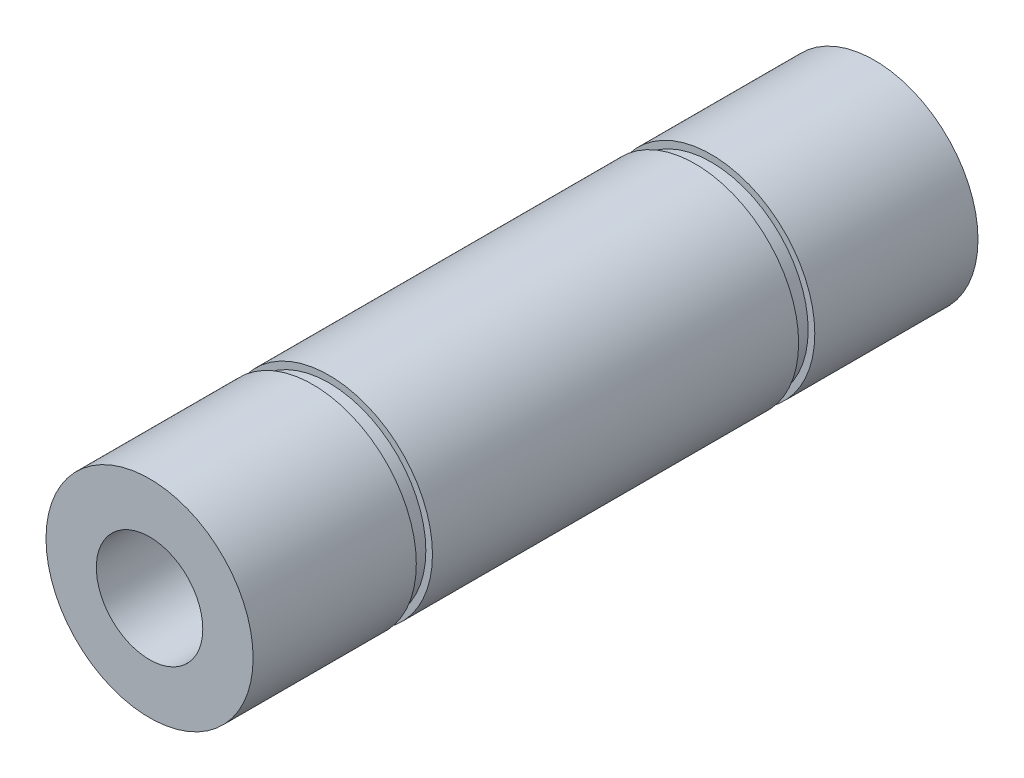
ISO-10303-21;
HEADER;
FILE_DESCRIPTION(('STEP AP214'),'2;1');
FILE_NAME('part.step','',(''),(''),'','','');
FILE_SCHEMA(('AUTOMOTIVE_DESIGN { 1 0 10303 214 1 1 1 1 }'));
ENDSEC;
DATA;
#1=APPLICATION_CONTEXT('core data for automotive mechanical design processes');
#2=APPLICATION_PROTOCOL_DEFINITION('international standard','automotive_design',2000,#1);
#3=PRODUCT_CONTEXT('',#1,'mechanical');
#4=PRODUCT('Part','Part','',(#3));
#5=PRODUCT_RELATED_PRODUCT_CATEGORY('part','',(#4));
#6=PRODUCT_DEFINITION_FORMATION('','',#4);
#7=PRODUCT_DEFINITION_CONTEXT('part definition',#1,'design');
#8=PRODUCT_DEFINITION('design','',#6,#7);
#9=PRODUCT_DEFINITION_SHAPE('','',#8);
#10=(LENGTH_UNIT() NAMED_UNIT(*) SI_UNIT(.MILLI.,.METRE.));
#11=(NAMED_UNIT(*) PLANE_ANGLE_UNIT() SI_UNIT($,.RADIAN.));
#12=(NAMED_UNIT(*) SI_UNIT($,.STERADIAN.) SOLID_ANGLE_UNIT());
#13=UNCERTAINTY_MEASURE_WITH_UNIT(LENGTH_MEASURE(1.E-05),#10,'distance_accuracy_value','');
#14=(GEOMETRIC_REPRESENTATION_CONTEXT(3) GLOBAL_UNCERTAINTY_ASSIGNED_CONTEXT((#13)) GLOBAL_UNIT_ASSIGNED_CONTEXT((#10,
#11,#12)) REPRESENTATION_CONTEXT('',''));
#15=CARTESIAN_POINT('',(0.,0.,0.));
#16=DIRECTION('',(0.,0.,1.));
#17=DIRECTION('',(1.,0.,0.));
#18=AXIS2_PLACEMENT_3D('',#15,#16,#17);
#19=CARTESIAN_POINT('',(0.,0.,22.225));
#20=DIRECTION('',(0.,0.,-1.));
#21=DIRECTION('',(-1.,0.,0.));
#22=AXIS2_PLACEMENT_3D('',#19,#20,#21);
#23=CYLINDRICAL_SURFACE('',#22,6.35);
#24=CARTESIAN_POINT('',(0.,0.,-11.2268));
#25=DIRECTION('',(0.,0.,1.));
#26=DIRECTION('',(1.,0.,0.));
#27=AXIS2_PLACEMENT_3D('',#24,#25,#26);
#28=CIRCLE('',#27,6.35);
#29=CARTESIAN_POINT('',(6.35,0.,-11.2268));
#30=VERTEX_POINT('',#29);
#31=EDGE_CURVE('E70',#30,#30,#28,.T.);
#32=ORIENTED_EDGE('',*,*,#31,.T.);
#33=EDGE_LOOP('',(#32));
#34=FACE_BOUND('',#33,.T.);
#35=CARTESIAN_POINT('',(0.,0.,11.2268));
#36=DIRECTION('',(0.,0.,1.));
#37=DIRECTION('',(1.,0.,0.));
#38=AXIS2_PLACEMENT_3D('',#35,#36,#37);
#39=CIRCLE('',#38,6.35);
#40=CARTESIAN_POINT('',(6.35,0.,11.2268));
#41=VERTEX_POINT('',#40);
#42=EDGE_CURVE('E82',#41,#41,#39,.T.);
#43=ORIENTED_EDGE('',*,*,#42,.F.);
#44=EDGE_LOOP('',(#43));
#45=FACE_BOUND('',#44,.T.);
#46=ADVANCED_FACE('F36',(#34,#45),#23,.T.);
#47=CARTESIAN_POINT('',(0.,0.,22.225));
#48=DIRECTION('',(0.,0.,1.));
#49=DIRECTION('',(1.,0.,0.));
#50=AXIS2_PLACEMENT_3D('',#47,#48,#49);
#51=CIRCLE('',#50,6.35);
#52=CARTESIAN_POINT('',(6.35,0.,22.225));
#53=VERTEX_POINT('',#52);
#54=EDGE_CURVE('E10',#53,#53,#51,.T.);
#55=ORIENTED_EDGE('',*,*,#54,.F.);
#56=EDGE_LOOP('',(#55));
#57=FACE_BOUND('',#56,.T.);
#58=CARTESIAN_POINT('',(0.,0.,12.2174));
#59=DIRECTION('',(0.,0.,1.));
#60=DIRECTION('',(1.,0.,0.));
#61=AXIS2_PLACEMENT_3D('',#58,#59,#60);
#62=CIRCLE('',#61,6.35);
#63=CARTESIAN_POINT('',(6.35,0.,12.2174));
#64=VERTEX_POINT('',#63);
#65=EDGE_CURVE('E79',#64,#64,#62,.T.);
#66=ORIENTED_EDGE('',*,*,#65,.T.);
#67=EDGE_LOOP('',(#66));
#68=FACE_BOUND('',#67,.T.);
#69=ADVANCED_FACE('F89',(#57,#68),#23,.T.);
#70=CARTESIAN_POINT('',(0.,0.,-22.225));
#71=DIRECTION('',(0.,0.,1.));
#72=DIRECTION('',(1.,0.,0.));
#73=AXIS2_PLACEMENT_3D('',#70,#71,#72);
#74=CIRCLE('',#73,6.35);
#75=CARTESIAN_POINT('',(6.35,0.,-22.225));
#76=VERTEX_POINT('',#75);
#77=EDGE_CURVE('E43',#76,#76,#74,.T.);
#78=ORIENTED_EDGE('',*,*,#77,.T.);
#79=EDGE_LOOP('',(#78));
#80=FACE_BOUND('',#79,.T.);
#81=CARTESIAN_POINT('',(0.,0.,-12.2174));
#82=DIRECTION('',(0.,0.,1.));
#83=DIRECTION('',(1.,0.,0.));
#84=AXIS2_PLACEMENT_3D('',#81,#82,#83);
#85=CIRCLE('',#84,6.35);
#86=CARTESIAN_POINT('',(6.35,0.,-12.2174));
#87=VERTEX_POINT('',#86);
#88=EDGE_CURVE('E67',#87,#87,#85,.T.);
#89=ORIENTED_EDGE('',*,*,#88,.F.);
#90=EDGE_LOOP('',(#89));
#91=FACE_BOUND('',#90,.T.);
#92=ADVANCED_FACE('F91',(#80,#91),#23,.T.);
#93=CARTESIAN_POINT('',(0.,0.,22.225));
#94=DIRECTION('',(0.,0.,1.));
#95=DIRECTION('',(1.,0.,0.));
#96=AXIS2_PLACEMENT_3D('',#93,#94,#95);
#97=PLANE('',#96);
#98=CARTESIAN_POINT('',(0.,0.,22.225));
#99=DIRECTION('',(0.,0.,1.));
#100=DIRECTION('',(1.,0.,0.));
#101=AXIS2_PLACEMENT_3D('',#98,#99,#100);
#102=CIRCLE('',#101,3.26389999999999);
#103=CARTESIAN_POINT('',(3.26389999999999,0.,22.225));
#104=VERTEX_POINT('',#103);
#105=EDGE_CURVE('E52',#104,#104,#102,.T.);
#106=ORIENTED_EDGE('',*,*,#105,.F.);
#107=EDGE_LOOP('',(#106));
#108=FACE_BOUND('',#107,.T.);
#109=ORIENTED_EDGE('',*,*,#54,.T.);
#110=EDGE_LOOP('',(#109));
#111=FACE_BOUND('',#110,.T.);
#112=ADVANCED_FACE('F97',(#108,#111),#97,.T.);
#113=CARTESIAN_POINT('',(0.,0.,-22.225));
#114=DIRECTION('',(0.,0.,1.));
#115=DIRECTION('',(1.,0.,0.));
#116=AXIS2_PLACEMENT_3D('',#113,#114,#115);
#117=PLANE('',#116);
#118=CARTESIAN_POINT('',(0.,0.,-22.225));
#119=DIRECTION('',(0.,0.,-1.));
#120=DIRECTION('',(-1.,0.,0.));
#121=AXIS2_PLACEMENT_3D('',#118,#119,#120);
#122=CIRCLE('',#121,3.26389999999999);
#123=CARTESIAN_POINT('',(-3.26389999999999,0.,-22.225));
#124=VERTEX_POINT('',#123);
#125=EDGE_CURVE('E58',#124,#124,#122,.T.);
#126=ORIENTED_EDGE('',*,*,#125,.F.);
#127=EDGE_LOOP('',(#126));
#128=FACE_BOUND('',#127,.T.);
#129=ORIENTED_EDGE('',*,*,#77,.F.);
#130=EDGE_LOOP('',(#129));
#131=FACE_BOUND('',#130,.T.);
#132=ADVANCED_FACE('F102',(#128,#131),#117,.F.);
#133=CARTESIAN_POINT('',(0.,0.,1.905));
#134=DIRECTION('',(0.,0.,1.));
#135=DIRECTION('',(1.,0.,0.));
#136=AXIS2_PLACEMENT_3D('',#133,#134,#135);
#137=CONICAL_SURFACE('',#136,3.2639,1.02974425867665);
#138=CARTESIAN_POINT('',(0.,0.,0.));
#139=DIRECTION('',(0.,0.,-1.));
#140=DIRECTION('',(-1.,0.,0.));
#141=AXIS2_PLACEMENT_3D('',#138,#139,#140);
#142=CIRCLE('',#141,0.0934475861222737);
#143=CARTESIAN_POINT('',(-0.0934475861222737,0.,0.));
#144=VERTEX_POINT('',#143);
#145=EDGE_CURVE('E39',#144,#144,#142,.T.);
#146=ORIENTED_EDGE('',*,*,#145,.T.);
#147=EDGE_LOOP('',(#146));
#148=FACE_BOUND('',#147,.T.);
#149=CARTESIAN_POINT('',(0.,0.,1.905));
#150=DIRECTION('',(0.,0.,1.));
#151=DIRECTION('',(1.,0.,0.));
#152=AXIS2_PLACEMENT_3D('',#149,#150,#151);
#153=CIRCLE('',#152,3.2639);
#154=CARTESIAN_POINT('',(3.2639,0.,1.905));
#155=VERTEX_POINT('',#154);
#156=EDGE_CURVE('E48',#155,#155,#153,.T.);
#157=ORIENTED_EDGE('',*,*,#156,.T.);
#158=EDGE_LOOP('',(#157));
#159=FACE_BOUND('',#158,.T.);
#160=ADVANCED_FACE('F140',(#148,#159),#137,.F.);
#161=CARTESIAN_POINT('',(0.,0.,22.225));
#162=DIRECTION('',(0.,0.,1.));
#163=DIRECTION('',(1.,0.,0.));
#164=AXIS2_PLACEMENT_3D('',#161,#162,#163);
#165=CYLINDRICAL_SURFACE('',#164,3.26389999999999);
#166=ORIENTED_EDGE('',*,*,#156,.F.);
#167=EDGE_LOOP('',(#166));
#168=FACE_BOUND('',#167,.T.);
#169=ORIENTED_EDGE('',*,*,#105,.T.);
#170=EDGE_LOOP('',(#169));
#171=FACE_BOUND('',#170,.T.);
#172=ADVANCED_FACE('F136',(#168,#171),#165,.F.);
#173=CARTESIAN_POINT('',(0.,0.,-1.90499999999999));
#174=DIRECTION('',(0.,0.,-1.));
#175=DIRECTION('',(-1.,0.,0.));
#176=AXIS2_PLACEMENT_3D('',#173,#174,#175);
#177=CONICAL_SURFACE('',#176,3.26389999999999,1.02974425867665);
#178=CARTESIAN_POINT('',(0.,0.,-1.90499999999999));
#179=DIRECTION('',(0.,0.,-1.));
#180=DIRECTION('',(-1.,0.,0.));
#181=AXIS2_PLACEMENT_3D('',#178,#179,#180);
#182=CIRCLE('',#181,3.26389999999999);
#183=CARTESIAN_POINT('',(-3.26389999999999,0.,-1.90499999999999));
#184=VERTEX_POINT('',#183);
#185=EDGE_CURVE('E55',#184,#184,#182,.T.);
#186=ORIENTED_EDGE('',*,*,#185,.T.);
#187=EDGE_LOOP('',(#186));
#188=FACE_BOUND('',#187,.T.);
#189=ORIENTED_EDGE('',*,*,#145,.F.);
#190=EDGE_LOOP('',(#189));
#191=FACE_BOUND('',#190,.T.);
#192=ADVANCED_FACE('F130',(#188,#191),#177,.F.);
#193=CARTESIAN_POINT('',(0.,0.,-22.225));
#194=DIRECTION('',(0.,0.,-1.));
#195=DIRECTION('',(-1.,0.,0.));
#196=AXIS2_PLACEMENT_3D('',#193,#194,#195);
#197=CYLINDRICAL_SURFACE('',#196,3.26389999999999);
#198=ORIENTED_EDGE('',*,*,#185,.F.);
#199=EDGE_LOOP('',(#198));
#200=FACE_BOUND('',#199,.T.);
#201=ORIENTED_EDGE('',*,*,#125,.T.);
#202=EDGE_LOOP('',(#201));
#203=FACE_BOUND('',#202,.T.);
#204=ADVANCED_FACE('F124',(#200,#203),#197,.F.);
#205=CARTESIAN_POINT('',(0.,6.35,-11.2268));
#206=DIRECTION('',(0.,0.,-1.));
#207=DIRECTION('',(-1.,0.,0.));
#208=AXIS2_PLACEMENT_3D('',#205,#206,#207);
#209=PLANE('',#208);
#210=CARTESIAN_POINT('',(0.,0.,-11.2268));
#211=DIRECTION('',(0.,0.,1.));
#212=DIRECTION('',(1.,0.,0.));
#213=AXIS2_PLACEMENT_3D('',#210,#211,#212);
#214=CIRCLE('',#213,5.9436);
#215=CARTESIAN_POINT('',(5.9436,0.,-11.2268));
#216=VERTEX_POINT('',#215);
#217=EDGE_CURVE('E61',#216,#216,#214,.T.);
#218=ORIENTED_EDGE('',*,*,#217,.T.);
#219=EDGE_LOOP('',(#218));
#220=FACE_BOUND('',#219,.T.);
#221=ORIENTED_EDGE('',*,*,#31,.F.);
#222=EDGE_LOOP('',(#221));
#223=FACE_BOUND('',#222,.T.);
#224=ADVANCED_FACE('F118',(#220,#223),#209,.T.);
#225=CARTESIAN_POINT('',(0.,0.,22.225));
#226=DIRECTION('',(0.,0.,1.));
#227=DIRECTION('',(1.,0.,0.));
#228=AXIS2_PLACEMENT_3D('',#225,#226,#227);
#229=CYLINDRICAL_SURFACE('',#228,5.9436);
#230=CARTESIAN_POINT('',(0.,0.,-12.2174));
#231=DIRECTION('',(0.,0.,1.));
#232=DIRECTION('',(1.,0.,0.));
#233=AXIS2_PLACEMENT_3D('',#230,#231,#232);
#234=CIRCLE('',#233,5.9436);
#235=CARTESIAN_POINT('',(5.9436,0.,-12.2174));
#236=VERTEX_POINT('',#235);
#237=EDGE_CURVE('E64',#236,#236,#234,.T.);
#238=ORIENTED_EDGE('',*,*,#237,.T.);
#239=EDGE_LOOP('',(#238));
#240=FACE_BOUND('',#239,.T.);
#241=ORIENTED_EDGE('',*,*,#217,.F.);
#242=EDGE_LOOP('',(#241));
#243=FACE_BOUND('',#242,.T.);
#244=ADVANCED_FACE('F112',(#240,#243),#229,.T.);
#245=CARTESIAN_POINT('',(0.,6.35,-12.2174));
#246=DIRECTION('',(0.,0.,1.));
#247=DIRECTION('',(1.,0.,0.));
#248=AXIS2_PLACEMENT_3D('',#245,#246,#247);
#249=PLANE('',#248);
#250=ORIENTED_EDGE('',*,*,#88,.T.);
#251=EDGE_LOOP('',(#250));
#252=FACE_BOUND('',#251,.T.);
#253=ORIENTED_EDGE('',*,*,#237,.F.);
#254=EDGE_LOOP('',(#253));
#255=FACE_BOUND('',#254,.T.);
#256=ADVANCED_FACE('F109',(#252,#255),#249,.T.);
#257=CARTESIAN_POINT('',(0.,6.35,11.2268));
#258=DIRECTION('',(0.,0.,1.));
#259=DIRECTION('',(-1.,0.,0.));
#260=AXIS2_PLACEMENT_3D('',#257,#258,#259);
#261=PLANE('',#260);
#262=CARTESIAN_POINT('',(0.,0.,11.2268));
#263=DIRECTION('',(0.,0.,1.));
#264=DIRECTION('',(1.,0.,0.));
#265=AXIS2_PLACEMENT_3D('',#262,#263,#264);
#266=CIRCLE('',#265,5.9436);
#267=CARTESIAN_POINT('',(5.9436,0.,11.2268));
#268=VERTEX_POINT('',#267);
#269=EDGE_CURVE('E73',#268,#268,#266,.T.);
#270=ORIENTED_EDGE('',*,*,#269,.F.);
#271=EDGE_LOOP('',(#270));
#272=FACE_BOUND('',#271,.T.);
#273=ORIENTED_EDGE('',*,*,#42,.T.);
#274=EDGE_LOOP('',(#273));
#275=FACE_BOUND('',#274,.T.);
#276=ADVANCED_FACE('F86',(#272,#275),#261,.T.);
#277=CARTESIAN_POINT('',(0.,0.,-22.225));
#278=DIRECTION('',(0.,0.,-1.));
#279=DIRECTION('',(1.,0.,0.));
#280=AXIS2_PLACEMENT_3D('',#277,#278,#279);
#281=CYLINDRICAL_SURFACE('',#280,5.9436);
#282=CARTESIAN_POINT('',(0.,0.,12.2174));
#283=DIRECTION('',(0.,0.,1.));
#284=DIRECTION('',(1.,0.,0.));
#285=AXIS2_PLACEMENT_3D('',#282,#283,#284);
#286=CIRCLE('',#285,5.9436);
#287=CARTESIAN_POINT('',(5.9436,0.,12.2174));
#288=VERTEX_POINT('',#287);
#289=EDGE_CURVE('E76',#288,#288,#286,.T.);
#290=ORIENTED_EDGE('',*,*,#289,.F.);
#291=EDGE_LOOP('',(#290));
#292=FACE_BOUND('',#291,.T.);
#293=ORIENTED_EDGE('',*,*,#269,.T.);
#294=EDGE_LOOP('',(#293));
#295=FACE_BOUND('',#294,.T.);
#296=ADVANCED_FACE('F210',(#292,#295),#281,.T.);
#297=CARTESIAN_POINT('',(0.,6.35,12.2174));
#298=DIRECTION('',(0.,0.,-1.));
#299=DIRECTION('',(1.,0.,0.));
#300=AXIS2_PLACEMENT_3D('',#297,#298,#299);
#301=PLANE('',#300);
#302=ORIENTED_EDGE('',*,*,#65,.F.);
#303=EDGE_LOOP('',(#302));
#304=FACE_BOUND('',#303,.T.);
#305=ORIENTED_EDGE('',*,*,#289,.T.);
#306=EDGE_LOOP('',(#305));
#307=FACE_BOUND('',#306,.T.);
#308=ADVANCED_FACE('F220',(#304,#307),#301,.T.);
#309=CLOSED_SHELL('',(#46,#69,#92,#112,#132,#160,#172,#192,#204,#224,#244,#256,#276,#296,#308));
#310=MANIFOLD_SOLID_BREP('B2',#309);
#311=ADVANCED_BREP_SHAPE_REPRESENTATION('',(#18,#310),#14);
#312=SHAPE_DEFINITION_REPRESENTATION(#9,#311);
ENDSEC;
END-ISO-10303-21;
